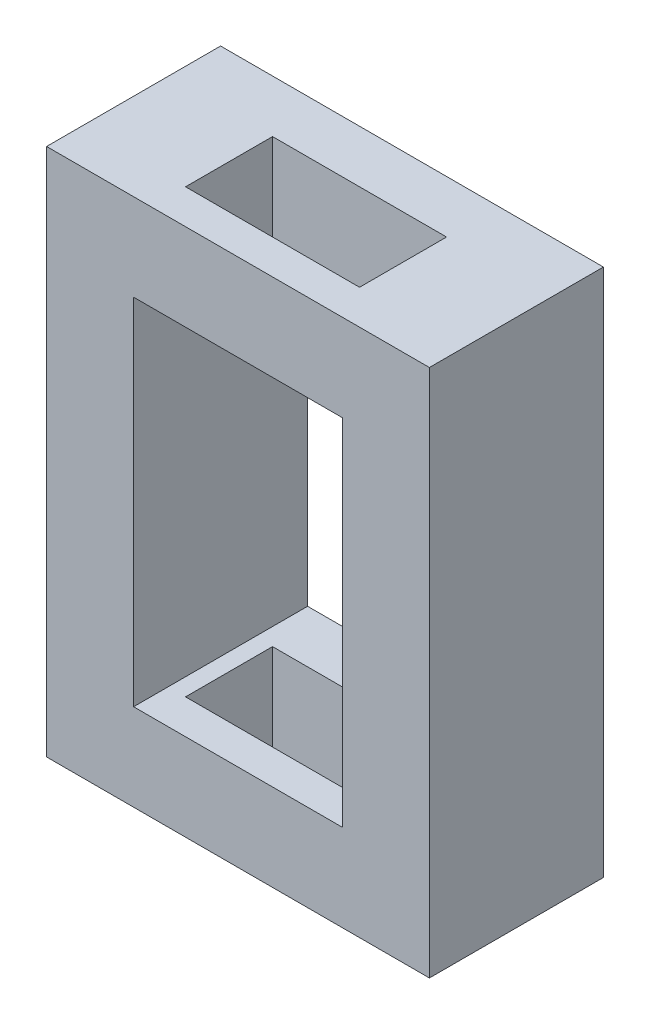
ISO-10303-21;
HEADER;
FILE_DESCRIPTION(('STEP AP214'),'2;1');
FILE_NAME('part.step','',(''),(''),'','','');
FILE_SCHEMA(('AUTOMOTIVE_DESIGN { 1 0 10303 214 1 1 1 1 }'));
ENDSEC;
DATA;
#1=APPLICATION_CONTEXT('core data for automotive mechanical design processes');
#2=APPLICATION_PROTOCOL_DEFINITION('international standard','automotive_design',2000,#1);
#3=PRODUCT_CONTEXT('',#1,'mechanical');
#4=PRODUCT('Part','Part','',(#3));
#5=PRODUCT_RELATED_PRODUCT_CATEGORY('part','',(#4));
#6=PRODUCT_DEFINITION_FORMATION('','',#4);
#7=PRODUCT_DEFINITION_CONTEXT('part definition',#1,'design');
#8=PRODUCT_DEFINITION('design','',#6,#7);
#9=PRODUCT_DEFINITION_SHAPE('','',#8);
#10=(LENGTH_UNIT() NAMED_UNIT(*) SI_UNIT(.MILLI.,.METRE.));
#11=(NAMED_UNIT(*) PLANE_ANGLE_UNIT() SI_UNIT($,.RADIAN.));
#12=(NAMED_UNIT(*) SI_UNIT($,.STERADIAN.) SOLID_ANGLE_UNIT());
#13=UNCERTAINTY_MEASURE_WITH_UNIT(LENGTH_MEASURE(1.E-05),#10,'distance_accuracy_value','');
#14=(GEOMETRIC_REPRESENTATION_CONTEXT(3) GLOBAL_UNCERTAINTY_ASSIGNED_CONTEXT((#13)) GLOBAL_UNIT_ASSIGNED_CONTEXT((#10,
#11,#12)) REPRESENTATION_CONTEXT('',''));
#15=CARTESIAN_POINT('',(0.,0.,0.));
#16=DIRECTION('',(0.,0.,1.));
#17=DIRECTION('',(1.,0.,0.));
#18=AXIS2_PLACEMENT_3D('',#15,#16,#17);
#19=CARTESIAN_POINT('',(0.,0.,5.));
#20=DIRECTION('',(0.,0.,1.));
#21=DIRECTION('',(1.,0.,0.));
#22=AXIS2_PLACEMENT_3D('',#19,#20,#21);
#23=PLANE('',#22);
#24=DIRECTION('',(0.,-1.,0.));
#25=VECTOR('',#24,1.);
#26=CARTESIAN_POINT('',(-10.9972656089953,10.4978386203069,5.));
#27=LINE('',#26,#25);
#28=CARTESIAN_POINT('',(-10.9972656089953,10.4978386203069,5.));
#29=VERTEX_POINT('',#28);
#30=CARTESIAN_POINT('',(-10.9972656089953,-4.69446907200079,5.));
#31=VERTEX_POINT('',#30);
#32=EDGE_CURVE('E266',#29,#31,#27,.T.);
#33=ORIENTED_EDGE('',*,*,#32,.T.);
#34=DIRECTION('',(1.,0.,0.));
#35=VECTOR('',#34,1.);
#36=CARTESIAN_POINT('',(-10.9972656089953,-4.69446907200079,5.));
#37=LINE('',#36,#35);
#38=CARTESIAN_POINT('',(0.00273439100465997,-4.69446907200079,5.));
#39=VERTEX_POINT('',#38);
#40=EDGE_CURVE('E270',#31,#39,#37,.T.);
#41=ORIENTED_EDGE('',*,*,#40,.T.);
#42=DIRECTION('',(0.,1.,0.));
#43=VECTOR('',#42,1.);
#44=CARTESIAN_POINT('',(0.00273439100465823,10.4978386203069,5.));
#45=LINE('',#44,#43);
#46=CARTESIAN_POINT('',(0.00273439100465823,10.4978386203069,5.));
#47=VERTEX_POINT('',#46);
#48=EDGE_CURVE('E274',#39,#47,#45,.T.);
#49=ORIENTED_EDGE('',*,*,#48,.T.);
#50=DIRECTION('',(-1.,0.,0.));
#51=VECTOR('',#50,1.);
#52=CARTESIAN_POINT('',(-10.9972656089953,10.4978386203069,5.));
#53=LINE('',#52,#51);
#54=EDGE_CURVE('E277',#47,#29,#53,.T.);
#55=ORIENTED_EDGE('',*,*,#54,.T.);
#56=EDGE_LOOP('',(#33,#41,#49,#55));
#57=FACE_BOUND('',#56,.T.);
#58=DIRECTION('',(1.,0.,0.));
#59=VECTOR('',#58,1.);
#60=CARTESIAN_POINT('',(-8.49726560899534,-2.19446907200079,5.));
#61=LINE('',#60,#59);
#62=CARTESIAN_POINT('',(-8.49726560899534,-2.19446907200079,5.));
#63=VERTEX_POINT('',#62);
#64=CARTESIAN_POINT('',(-2.49726560899534,-2.19446907200079,5.));
#65=VERTEX_POINT('',#64);
#66=EDGE_CURVE('E226',#63,#65,#61,.T.);
#67=ORIENTED_EDGE('',*,*,#66,.F.);
#68=DIRECTION('',(0.,-1.,0.));
#69=VECTOR('',#68,1.);
#70=CARTESIAN_POINT('',(-8.49726560899534,7.99783862030694,5.));
#71=LINE('',#70,#69);
#72=CARTESIAN_POINT('',(-8.49726560899534,7.99783862030694,5.));
#73=VERTEX_POINT('',#72);
#74=EDGE_CURVE('E223',#73,#63,#71,.T.);
#75=ORIENTED_EDGE('',*,*,#74,.F.);
#76=DIRECTION('',(-1.,0.,0.));
#77=VECTOR('',#76,1.);
#78=CARTESIAN_POINT('',(-8.49726560899534,7.99783862030694,5.));
#79=LINE('',#78,#77);
#80=CARTESIAN_POINT('',(-2.49726560899534,7.99783862030694,5.));
#81=VERTEX_POINT('',#80);
#82=EDGE_CURVE('E234',#81,#73,#79,.T.);
#83=ORIENTED_EDGE('',*,*,#82,.F.);
#84=DIRECTION('',(0.,1.,0.));
#85=VECTOR('',#84,1.);
#86=CARTESIAN_POINT('',(-2.49726560899534,7.99783862030694,5.));
#87=LINE('',#86,#85);
#88=EDGE_CURVE('E230',#65,#81,#87,.T.);
#89=ORIENTED_EDGE('',*,*,#88,.F.);
#90=EDGE_LOOP('',(#67,#75,#83,#89));
#91=FACE_BOUND('',#90,.T.);
#92=ADVANCED_FACE('F38',(#57,#91),#23,.T.);
#93=CARTESIAN_POINT('',(0.,0.,0.));
#94=DIRECTION('',(0.,0.,1.));
#95=DIRECTION('',(1.,0.,0.));
#96=AXIS2_PLACEMENT_3D('',#93,#94,#95);
#97=PLANE('',#96);
#98=DIRECTION('',(0.,-1.,0.));
#99=VECTOR('',#98,1.);
#100=CARTESIAN_POINT('',(-10.9972656089953,10.4978386203069,0.));
#101=LINE('',#100,#99);
#102=CARTESIAN_POINT('',(-10.9972656089953,10.4978386203069,0.));
#103=VERTEX_POINT('',#102);
#104=CARTESIAN_POINT('',(-10.9972656089953,-4.69446907200079,0.));
#105=VERTEX_POINT('',#104);
#106=EDGE_CURVE('E265',#103,#105,#101,.T.);
#107=ORIENTED_EDGE('',*,*,#106,.F.);
#108=DIRECTION('',(-1.,0.,0.));
#109=VECTOR('',#108,1.);
#110=CARTESIAN_POINT('',(-10.9972656089953,10.4978386203069,0.));
#111=LINE('',#110,#109);
#112=CARTESIAN_POINT('',(0.00273439100465823,10.4978386203069,0.));
#113=VERTEX_POINT('',#112);
#114=EDGE_CURVE('E271',#113,#103,#111,.T.);
#115=ORIENTED_EDGE('',*,*,#114,.F.);
#116=DIRECTION('',(0.,1.,0.));
#117=VECTOR('',#116,1.);
#118=CARTESIAN_POINT('',(0.00273439100465823,10.4978386203069,0.));
#119=LINE('',#118,#117);
#120=CARTESIAN_POINT('',(0.00273439100465997,-4.69446907200079,0.));
#121=VERTEX_POINT('',#120);
#122=EDGE_CURVE('E287',#121,#113,#119,.T.);
#123=ORIENTED_EDGE('',*,*,#122,.F.);
#124=DIRECTION('',(1.,0.,0.));
#125=VECTOR('',#124,1.);
#126=CARTESIAN_POINT('',(-10.9972656089953,-4.69446907200079,0.));
#127=LINE('',#126,#125);
#128=EDGE_CURVE('E284',#105,#121,#127,.T.);
#129=ORIENTED_EDGE('',*,*,#128,.F.);
#130=EDGE_LOOP('',(#107,#115,#123,#129));
#131=FACE_BOUND('',#130,.T.);
#132=DIRECTION('',(0.,-1.,0.));
#133=VECTOR('',#132,1.);
#134=CARTESIAN_POINT('',(-8.49726560899534,7.99783862030694,0.));
#135=LINE('',#134,#133);
#136=CARTESIAN_POINT('',(-8.49726560899534,7.99783862030694,0.));
#137=VERTEX_POINT('',#136);
#138=CARTESIAN_POINT('',(-8.49726560899534,-2.19446907200079,0.));
#139=VERTEX_POINT('',#138);
#140=EDGE_CURVE('E222',#137,#139,#135,.T.);
#141=ORIENTED_EDGE('',*,*,#140,.T.);
#142=DIRECTION('',(1.,0.,0.));
#143=VECTOR('',#142,1.);
#144=CARTESIAN_POINT('',(-8.49726560899534,-2.19446907200079,0.));
#145=LINE('',#144,#143);
#146=CARTESIAN_POINT('',(-2.49726560899534,-2.19446907200079,0.));
#147=VERTEX_POINT('',#146);
#148=EDGE_CURVE('E241',#139,#147,#145,.T.);
#149=ORIENTED_EDGE('',*,*,#148,.T.);
#150=DIRECTION('',(0.,1.,0.));
#151=VECTOR('',#150,1.);
#152=CARTESIAN_POINT('',(-2.49726560899534,7.99783862030694,0.));
#153=LINE('',#152,#151);
#154=CARTESIAN_POINT('',(-2.49726560899534,7.99783862030694,0.));
#155=VERTEX_POINT('',#154);
#156=EDGE_CURVE('E245',#147,#155,#153,.T.);
#157=ORIENTED_EDGE('',*,*,#156,.T.);
#158=DIRECTION('',(-1.,0.,0.));
#159=VECTOR('',#158,1.);
#160=CARTESIAN_POINT('',(-8.49726560899534,7.99783862030694,0.));
#161=LINE('',#160,#159);
#162=EDGE_CURVE('E227',#155,#137,#161,.T.);
#163=ORIENTED_EDGE('',*,*,#162,.T.);
#164=EDGE_LOOP('',(#141,#149,#157,#163));
#165=FACE_BOUND('',#164,.T.);
#166=ADVANCED_FACE('F335',(#131,#165),#97,.F.);
#167=CARTESIAN_POINT('',(-10.9972656089953,10.4978386203069,5.));
#168=DIRECTION('',(1.,0.,0.));
#169=DIRECTION('',(0.,0.,-1.));
#170=AXIS2_PLACEMENT_3D('',#167,#168,#169);
#171=PLANE('',#170);
#172=ORIENTED_EDGE('',*,*,#106,.T.);
#173=DIRECTION('',(0.,0.,-1.));
#174=VECTOR('',#173,1.);
#175=CARTESIAN_POINT('',(-10.9972656089953,-4.69446907200079,5.));
#176=LINE('',#175,#174);
#177=EDGE_CURVE('E303',#31,#105,#176,.T.);
#178=ORIENTED_EDGE('',*,*,#177,.F.);
#179=ORIENTED_EDGE('',*,*,#32,.F.);
#180=DIRECTION('',(0.,0.,-1.));
#181=VECTOR('',#180,1.);
#182=CARTESIAN_POINT('',(-10.9972656089953,10.4978386203069,5.));
#183=LINE('',#182,#181);
#184=EDGE_CURVE('E280',#29,#103,#183,.T.);
#185=ORIENTED_EDGE('',*,*,#184,.T.);
#186=EDGE_LOOP('',(#172,#178,#179,#185));
#187=FACE_BOUND('',#186,.T.);
#188=ADVANCED_FACE('F40',(#187),#171,.F.);
#189=CARTESIAN_POINT('',(-10.9972656089953,-4.69446907200079,5.));
#190=DIRECTION('',(0.,1.,0.));
#191=DIRECTION('',(0.,0.,1.));
#192=AXIS2_PLACEMENT_3D('',#189,#190,#191);
#193=PLANE('',#192);
#194=DIRECTION('',(-1.,0.,0.));
#195=VECTOR('',#194,1.);
#196=CARTESIAN_POINT('',(-10.9972656089953,-4.69446907200079,1.50713672197687));
#197=LINE('',#196,#195);
#198=CARTESIAN_POINT('',(-2.99726560899534,-4.69446907200079,1.50713672197687));
#199=VERTEX_POINT('',#198);
#200=CARTESIAN_POINT('',(-7.99726560899534,-4.69446907200079,1.50713672197687));
#201=VERTEX_POINT('',#200);
#202=EDGE_CURVE('E210',#199,#201,#197,.T.);
#203=ORIENTED_EDGE('',*,*,#202,.T.);
#204=DIRECTION('',(0.,0.,1.));
#205=VECTOR('',#204,1.);
#206=CARTESIAN_POINT('',(-7.99726560899534,-4.69446907200079,5.));
#207=LINE('',#206,#205);
#208=CARTESIAN_POINT('',(-7.99726560899534,-4.69446907200079,4.00713672197687));
#209=VERTEX_POINT('',#208);
#210=EDGE_CURVE('E218',#201,#209,#207,.T.);
#211=ORIENTED_EDGE('',*,*,#210,.T.);
#212=DIRECTION('',(1.,0.,0.));
#213=VECTOR('',#212,1.);
#214=CARTESIAN_POINT('',(-10.9972656089953,-4.69446907200079,4.00713672197687));
#215=LINE('',#214,#213);
#216=CARTESIAN_POINT('',(-2.99726560899534,-4.69446907200079,4.00713672197687));
#217=VERTEX_POINT('',#216);
#218=EDGE_CURVE('E196',#209,#217,#215,.T.);
#219=ORIENTED_EDGE('',*,*,#218,.T.);
#220=DIRECTION('',(0.,0.,-1.));
#221=VECTOR('',#220,1.);
#222=CARTESIAN_POINT('',(-2.99726560899534,-4.69446907200079,5.));
#223=LINE('',#222,#221);
#224=EDGE_CURVE('E203',#217,#199,#223,.T.);
#225=ORIENTED_EDGE('',*,*,#224,.T.);
#226=EDGE_LOOP('',(#203,#211,#219,#225));
#227=FACE_BOUND('',#226,.T.);
#228=ORIENTED_EDGE('',*,*,#128,.T.);
#229=DIRECTION('',(0.,0.,-1.));
#230=VECTOR('',#229,1.);
#231=CARTESIAN_POINT('',(0.00273439100465997,-4.69446907200079,5.));
#232=LINE('',#231,#230);
#233=EDGE_CURVE('E299',#39,#121,#232,.T.);
#234=ORIENTED_EDGE('',*,*,#233,.F.);
#235=ORIENTED_EDGE('',*,*,#40,.F.);
#236=ORIENTED_EDGE('',*,*,#177,.T.);
#237=EDGE_LOOP('',(#228,#234,#235,#236));
#238=FACE_BOUND('',#237,.T.);
#239=ADVANCED_FACE('F352',(#227,#238),#193,.F.);
#240=CARTESIAN_POINT('',(0.00273439100465823,10.4978386203069,5.));
#241=DIRECTION('',(-1.,0.,0.));
#242=DIRECTION('',(0.,-1.,0.));
#243=AXIS2_PLACEMENT_3D('',#240,#241,#242);
#244=PLANE('',#243);
#245=ORIENTED_EDGE('',*,*,#122,.T.);
#246=DIRECTION('',(0.,0.,-1.));
#247=VECTOR('',#246,1.);
#248=CARTESIAN_POINT('',(0.00273439100465823,10.4978386203069,5.));
#249=LINE('',#248,#247);
#250=EDGE_CURVE('E295',#47,#113,#249,.T.);
#251=ORIENTED_EDGE('',*,*,#250,.F.);
#252=ORIENTED_EDGE('',*,*,#48,.F.);
#253=ORIENTED_EDGE('',*,*,#233,.T.);
#254=EDGE_LOOP('',(#245,#251,#252,#253));
#255=FACE_BOUND('',#254,.T.);
#256=ADVANCED_FACE('F350',(#255),#244,.F.);
#257=CARTESIAN_POINT('',(-10.9972656089953,10.4978386203069,5.));
#258=DIRECTION('',(0.,-1.,0.));
#259=DIRECTION('',(0.,0.,-1.));
#260=AXIS2_PLACEMENT_3D('',#257,#258,#259);
#261=PLANE('',#260);
#262=DIRECTION('',(1.,0.,0.));
#263=VECTOR('',#262,1.);
#264=CARTESIAN_POINT('',(-7.99726560899534,10.4978386203069,4.00713672197687));
#265=LINE('',#264,#263);
#266=CARTESIAN_POINT('',(-7.99726560899534,10.4978386203069,4.00713672197687));
#267=VERTEX_POINT('',#266);
#268=CARTESIAN_POINT('',(-2.99726560899534,10.4978386203069,4.00713672197687));
#269=VERTEX_POINT('',#268);
#270=EDGE_CURVE('E167',#267,#269,#265,.T.);
#271=ORIENTED_EDGE('',*,*,#270,.F.);
#272=DIRECTION('',(0.,0.,1.));
#273=VECTOR('',#272,1.);
#274=CARTESIAN_POINT('',(-7.99726560899534,10.4978386203069,1.50713672197687));
#275=LINE('',#274,#273);
#276=CARTESIAN_POINT('',(-7.99726560899534,10.4978386203069,1.50713672197687));
#277=VERTEX_POINT('',#276);
#278=EDGE_CURVE('E62',#277,#267,#275,.T.);
#279=ORIENTED_EDGE('',*,*,#278,.F.);
#280=DIRECTION('',(-1.,0.,0.));
#281=VECTOR('',#280,1.);
#282=CARTESIAN_POINT('',(-7.99726560899534,10.4978386203069,1.50713672197687));
#283=LINE('',#282,#281);
#284=CARTESIAN_POINT('',(-2.99726560899534,10.4978386203069,1.50713672197687));
#285=VERTEX_POINT('',#284);
#286=EDGE_CURVE('E176',#285,#277,#283,.T.);
#287=ORIENTED_EDGE('',*,*,#286,.F.);
#288=DIRECTION('',(0.,0.,-1.));
#289=VECTOR('',#288,1.);
#290=CARTESIAN_POINT('',(-2.99726560899534,10.4978386203069,1.50713672197687));
#291=LINE('',#290,#289);
#292=EDGE_CURVE('E157',#269,#285,#291,.T.);
#293=ORIENTED_EDGE('',*,*,#292,.F.);
#294=EDGE_LOOP('',(#271,#279,#287,#293));
#295=FACE_BOUND('',#294,.T.);
#296=ORIENTED_EDGE('',*,*,#114,.T.);
#297=ORIENTED_EDGE('',*,*,#184,.F.);
#298=ORIENTED_EDGE('',*,*,#54,.F.);
#299=ORIENTED_EDGE('',*,*,#250,.T.);
#300=EDGE_LOOP('',(#296,#297,#298,#299));
#301=FACE_BOUND('',#300,.T.);
#302=ADVANCED_FACE('F173',(#295,#301),#261,.F.);
#303=CARTESIAN_POINT('',(-8.49726560899534,7.99783862030694,5.));
#304=DIRECTION('',(1.,0.,0.));
#305=DIRECTION('',(0.,0.,-1.));
#306=AXIS2_PLACEMENT_3D('',#303,#304,#305);
#307=PLANE('',#306);
#308=ORIENTED_EDGE('',*,*,#140,.F.);
#309=DIRECTION('',(0.,0.,-1.));
#310=VECTOR('',#309,1.);
#311=CARTESIAN_POINT('',(-8.49726560899534,7.99783862030694,5.));
#312=LINE('',#311,#310);
#313=EDGE_CURVE('E237',#73,#137,#312,.T.);
#314=ORIENTED_EDGE('',*,*,#313,.F.);
#315=ORIENTED_EDGE('',*,*,#74,.T.);
#316=DIRECTION('',(0.,0.,-1.));
#317=VECTOR('',#316,1.);
#318=CARTESIAN_POINT('',(-8.49726560899534,-2.19446907200079,5.));
#319=LINE('',#318,#317);
#320=EDGE_CURVE('E261',#63,#139,#319,.T.);
#321=ORIENTED_EDGE('',*,*,#320,.T.);
#322=EDGE_LOOP('',(#308,#314,#315,#321));
#323=FACE_BOUND('',#322,.T.);
#324=ADVANCED_FACE('F345',(#323),#307,.T.);
#325=CARTESIAN_POINT('',(-8.49726560899534,-2.19446907200079,5.));
#326=DIRECTION('',(0.,1.,0.));
#327=DIRECTION('',(0.,0.,1.));
#328=AXIS2_PLACEMENT_3D('',#325,#326,#327);
#329=PLANE('',#328);
#330=DIRECTION('',(0.,0.,1.));
#331=VECTOR('',#330,1.);
#332=CARTESIAN_POINT('',(-7.99726560899534,-2.19446907200079,5.));
#333=LINE('',#332,#331);
#334=CARTESIAN_POINT('',(-7.99726560899534,-2.19446907200079,1.50713672197687));
#335=VERTEX_POINT('',#334);
#336=CARTESIAN_POINT('',(-7.99726560899534,-2.19446907200079,4.00713672197687));
#337=VERTEX_POINT('',#336);
#338=EDGE_CURVE('E214',#335,#337,#333,.T.);
#339=ORIENTED_EDGE('',*,*,#338,.F.);
#340=DIRECTION('',(-1.,0.,0.));
#341=VECTOR('',#340,1.);
#342=CARTESIAN_POINT('',(-8.49726560899534,-2.19446907200079,1.50713672197687));
#343=LINE('',#342,#341);
#344=CARTESIAN_POINT('',(-2.99726560899534,-2.19446907200079,1.50713672197687));
#345=VERTEX_POINT('',#344);
#346=EDGE_CURVE('E207',#345,#335,#343,.T.);
#347=ORIENTED_EDGE('',*,*,#346,.F.);
#348=DIRECTION('',(0.,0.,-1.));
#349=VECTOR('',#348,1.);
#350=CARTESIAN_POINT('',(-2.99726560899534,-2.19446907200079,5.));
#351=LINE('',#350,#349);
#352=CARTESIAN_POINT('',(-2.99726560899534,-2.19446907200079,4.00713672197687));
#353=VERTEX_POINT('',#352);
#354=EDGE_CURVE('E200',#353,#345,#351,.T.);
#355=ORIENTED_EDGE('',*,*,#354,.F.);
#356=DIRECTION('',(1.,0.,0.));
#357=VECTOR('',#356,1.);
#358=CARTESIAN_POINT('',(-8.49726560899534,-2.19446907200079,4.00713672197687));
#359=LINE('',#358,#357);
#360=EDGE_CURVE('E193',#337,#353,#359,.T.);
#361=ORIENTED_EDGE('',*,*,#360,.F.);
#362=EDGE_LOOP('',(#339,#347,#355,#361));
#363=FACE_BOUND('',#362,.T.);
#364=ORIENTED_EDGE('',*,*,#148,.F.);
#365=ORIENTED_EDGE('',*,*,#320,.F.);
#366=ORIENTED_EDGE('',*,*,#66,.T.);
#367=DIRECTION('',(0.,0.,-1.));
#368=VECTOR('',#367,1.);
#369=CARTESIAN_POINT('',(-2.49726560899534,-2.19446907200079,5.));
#370=LINE('',#369,#368);
#371=EDGE_CURVE('E258',#65,#147,#370,.T.);
#372=ORIENTED_EDGE('',*,*,#371,.T.);
#373=EDGE_LOOP('',(#364,#365,#366,#372));
#374=FACE_BOUND('',#373,.T.);
#375=ADVANCED_FACE('F382',(#363,#374),#329,.T.);
#376=CARTESIAN_POINT('',(-2.49726560899534,7.99783862030694,5.));
#377=DIRECTION('',(-1.,0.,0.));
#378=DIRECTION('',(0.,-1.,0.));
#379=AXIS2_PLACEMENT_3D('',#376,#377,#378);
#380=PLANE('',#379);
#381=ORIENTED_EDGE('',*,*,#156,.F.);
#382=ORIENTED_EDGE('',*,*,#371,.F.);
#383=ORIENTED_EDGE('',*,*,#88,.T.);
#384=DIRECTION('',(0.,0.,-1.));
#385=VECTOR('',#384,1.);
#386=CARTESIAN_POINT('',(-2.49726560899534,7.99783862030694,5.));
#387=LINE('',#386,#385);
#388=EDGE_CURVE('E255',#81,#155,#387,.T.);
#389=ORIENTED_EDGE('',*,*,#388,.T.);
#390=EDGE_LOOP('',(#381,#382,#383,#389));
#391=FACE_BOUND('',#390,.T.);
#392=ADVANCED_FACE('F386',(#391),#380,.T.);
#393=CARTESIAN_POINT('',(-8.49726560899534,7.99783862030694,5.));
#394=DIRECTION('',(0.,-1.,0.));
#395=DIRECTION('',(0.,0.,-1.));
#396=AXIS2_PLACEMENT_3D('',#393,#394,#395);
#397=PLANE('',#396);
#398=DIRECTION('',(0.,0.,-1.));
#399=VECTOR('',#398,1.);
#400=CARTESIAN_POINT('',(-7.99726560899534,7.99783862030694,5.));
#401=LINE('',#400,#399);
#402=CARTESIAN_POINT('',(-7.99726560899534,7.99783862030694,4.00713672197687));
#403=VERTEX_POINT('',#402);
#404=CARTESIAN_POINT('',(-7.99726560899534,7.99783862030694,1.50713672197687));
#405=VERTEX_POINT('',#404);
#406=EDGE_CURVE('E11',#403,#405,#401,.T.);
#407=ORIENTED_EDGE('',*,*,#406,.F.);
#408=DIRECTION('',(-1.,0.,0.));
#409=VECTOR('',#408,1.);
#410=CARTESIAN_POINT('',(-8.49726560899534,7.99783862030694,4.00713672197687));
#411=LINE('',#410,#409);
#412=CARTESIAN_POINT('',(-2.99726560899534,7.99783862030694,4.00713672197687));
#413=VERTEX_POINT('',#412);
#414=EDGE_CURVE('E307',#413,#403,#411,.T.);
#415=ORIENTED_EDGE('',*,*,#414,.F.);
#416=DIRECTION('',(0.,0.,1.));
#417=VECTOR('',#416,1.);
#418=CARTESIAN_POINT('',(-2.99726560899534,7.99783862030694,5.));
#419=LINE('',#418,#417);
#420=CARTESIAN_POINT('',(-2.99726560899534,7.99783862030694,1.50713672197687));
#421=VERTEX_POINT('',#420);
#422=EDGE_CURVE('E160',#421,#413,#419,.T.);
#423=ORIENTED_EDGE('',*,*,#422,.F.);
#424=DIRECTION('',(1.,0.,0.));
#425=VECTOR('',#424,1.);
#426=CARTESIAN_POINT('',(-8.49726560899534,7.99783862030694,1.50713672197687));
#427=LINE('',#426,#425);
#428=EDGE_CURVE('E47',#405,#421,#427,.T.);
#429=ORIENTED_EDGE('',*,*,#428,.F.);
#430=EDGE_LOOP('',(#407,#415,#423,#429));
#431=FACE_BOUND('',#430,.T.);
#432=ORIENTED_EDGE('',*,*,#162,.F.);
#433=ORIENTED_EDGE('',*,*,#388,.F.);
#434=ORIENTED_EDGE('',*,*,#82,.T.);
#435=ORIENTED_EDGE('',*,*,#313,.T.);
#436=EDGE_LOOP('',(#432,#433,#434,#435));
#437=FACE_BOUND('',#436,.T.);
#438=ADVANCED_FACE('F318',(#431,#437),#397,.T.);
#439=CARTESIAN_POINT('',(-7.99726560899534,-5.50216137969306,4.00713672197687));
#440=DIRECTION('',(0.,0.,1.));
#441=DIRECTION('',(1.,0.,0.));
#442=AXIS2_PLACEMENT_3D('',#439,#440,#441);
#443=PLANE('',#442);
#444=ORIENTED_EDGE('',*,*,#414,.T.);
#445=DIRECTION('',(0.,1.,0.));
#446=VECTOR('',#445,1.);
#447=CARTESIAN_POINT('',(-7.99726560899534,-5.50216137969306,4.00713672197687));
#448=LINE('',#447,#446);
#449=EDGE_CURVE('E169',#403,#267,#448,.T.);
#450=ORIENTED_EDGE('',*,*,#449,.T.);
#451=ORIENTED_EDGE('',*,*,#270,.T.);
#452=DIRECTION('',(0.,1.,0.));
#453=VECTOR('',#452,1.);
#454=CARTESIAN_POINT('',(-2.99726560899534,-5.50216137969306,4.00713672197687));
#455=LINE('',#454,#453);
#456=EDGE_CURVE('E152',#413,#269,#455,.T.);
#457=ORIENTED_EDGE('',*,*,#456,.F.);
#458=EDGE_LOOP('',(#444,#450,#451,#457));
#459=FACE_BOUND('',#458,.T.);
#460=ADVANCED_FACE('F168',(#459),#443,.F.);
#461=CARTESIAN_POINT('',(-2.99726560899534,-5.50216137969306,1.50713672197687));
#462=DIRECTION('',(1.,0.,0.));
#463=DIRECTION('',(0.,0.,-1.));
#464=AXIS2_PLACEMENT_3D('',#461,#462,#463);
#465=PLANE('',#464);
#466=ORIENTED_EDGE('',*,*,#422,.T.);
#467=ORIENTED_EDGE('',*,*,#456,.T.);
#468=ORIENTED_EDGE('',*,*,#292,.T.);
#469=DIRECTION('',(0.,1.,0.));
#470=VECTOR('',#469,1.);
#471=CARTESIAN_POINT('',(-2.99726560899534,-5.50216137969306,1.50713672197687));
#472=LINE('',#471,#470);
#473=EDGE_CURVE('E188',#421,#285,#472,.T.);
#474=ORIENTED_EDGE('',*,*,#473,.F.);
#475=EDGE_LOOP('',(#466,#467,#468,#474));
#476=FACE_BOUND('',#475,.T.);
#477=ADVANCED_FACE('F154',(#476),#465,.F.);
#478=CARTESIAN_POINT('',(-7.99726560899534,-5.50216137969306,1.50713672197687));
#479=DIRECTION('',(0.,0.,-1.));
#480=DIRECTION('',(-1.,0.,0.));
#481=AXIS2_PLACEMENT_3D('',#478,#479,#480);
#482=PLANE('',#481);
#483=ORIENTED_EDGE('',*,*,#428,.T.);
#484=ORIENTED_EDGE('',*,*,#473,.T.);
#485=ORIENTED_EDGE('',*,*,#286,.T.);
#486=DIRECTION('',(0.,1.,0.));
#487=VECTOR('',#486,1.);
#488=CARTESIAN_POINT('',(-7.99726560899534,-5.50216137969306,1.50713672197687));
#489=LINE('',#488,#487);
#490=EDGE_CURVE('E183',#405,#277,#489,.T.);
#491=ORIENTED_EDGE('',*,*,#490,.F.);
#492=EDGE_LOOP('',(#483,#484,#485,#491));
#493=FACE_BOUND('',#492,.T.);
#494=ADVANCED_FACE('F315',(#493),#482,.F.);
#495=CARTESIAN_POINT('',(-7.99726560899534,-5.50216137969306,1.50713672197687));
#496=DIRECTION('',(-1.,0.,0.));
#497=DIRECTION('',(0.,0.,1.));
#498=AXIS2_PLACEMENT_3D('',#495,#496,#497);
#499=PLANE('',#498);
#500=ORIENTED_EDGE('',*,*,#406,.T.);
#501=ORIENTED_EDGE('',*,*,#490,.T.);
#502=ORIENTED_EDGE('',*,*,#278,.T.);
#503=ORIENTED_EDGE('',*,*,#449,.F.);
#504=EDGE_LOOP('',(#500,#501,#502,#503));
#505=FACE_BOUND('',#504,.T.);
#506=ADVANCED_FACE('F320',(#505),#499,.F.);
#507=EDGE_CURVE('E186',#201,#335,#489,.T.);
#508=ORIENTED_EDGE('',*,*,#507,.T.);
#509=ORIENTED_EDGE('',*,*,#338,.T.);
#510=EDGE_CURVE('E164',#209,#337,#448,.T.);
#511=ORIENTED_EDGE('',*,*,#510,.F.);
#512=ORIENTED_EDGE('',*,*,#210,.F.);
#513=EDGE_LOOP('',(#508,#509,#511,#512));
#514=FACE_BOUND('',#513,.T.);
#515=ADVANCED_FACE('F323',(#514),#499,.F.);
#516=EDGE_CURVE('E187',#199,#345,#472,.T.);
#517=ORIENTED_EDGE('',*,*,#516,.T.);
#518=ORIENTED_EDGE('',*,*,#346,.T.);
#519=ORIENTED_EDGE('',*,*,#507,.F.);
#520=ORIENTED_EDGE('',*,*,#202,.F.);
#521=EDGE_LOOP('',(#517,#518,#519,#520));
#522=FACE_BOUND('',#521,.T.);
#523=ADVANCED_FACE('F329',(#522),#482,.F.);
#524=EDGE_CURVE('E54',#217,#353,#455,.T.);
#525=ORIENTED_EDGE('',*,*,#524,.T.);
#526=ORIENTED_EDGE('',*,*,#354,.T.);
#527=ORIENTED_EDGE('',*,*,#516,.F.);
#528=ORIENTED_EDGE('',*,*,#224,.F.);
#529=EDGE_LOOP('',(#525,#526,#527,#528));
#530=FACE_BOUND('',#529,.T.);
#531=ADVANCED_FACE('F413',(#530),#465,.F.);
#532=ORIENTED_EDGE('',*,*,#510,.T.);
#533=ORIENTED_EDGE('',*,*,#360,.T.);
#534=ORIENTED_EDGE('',*,*,#524,.F.);
#535=ORIENTED_EDGE('',*,*,#218,.F.);
#536=EDGE_LOOP('',(#532,#533,#534,#535));
#537=FACE_BOUND('',#536,.T.);
#538=ADVANCED_FACE('F410',(#537),#443,.F.);
#539=CLOSED_SHELL('',(#92,#166,#188,#239,#256,#302,#324,#375,#392,#438,#460,#477,#494,#506,#515,
#523,#531,#538));
#540=MANIFOLD_SOLID_BREP('B2',#539);
#541=ADVANCED_BREP_SHAPE_REPRESENTATION('',(#18,#540),#14);
#542=SHAPE_DEFINITION_REPRESENTATION(#9,#541);
ENDSEC;
END-ISO-10303-21;
